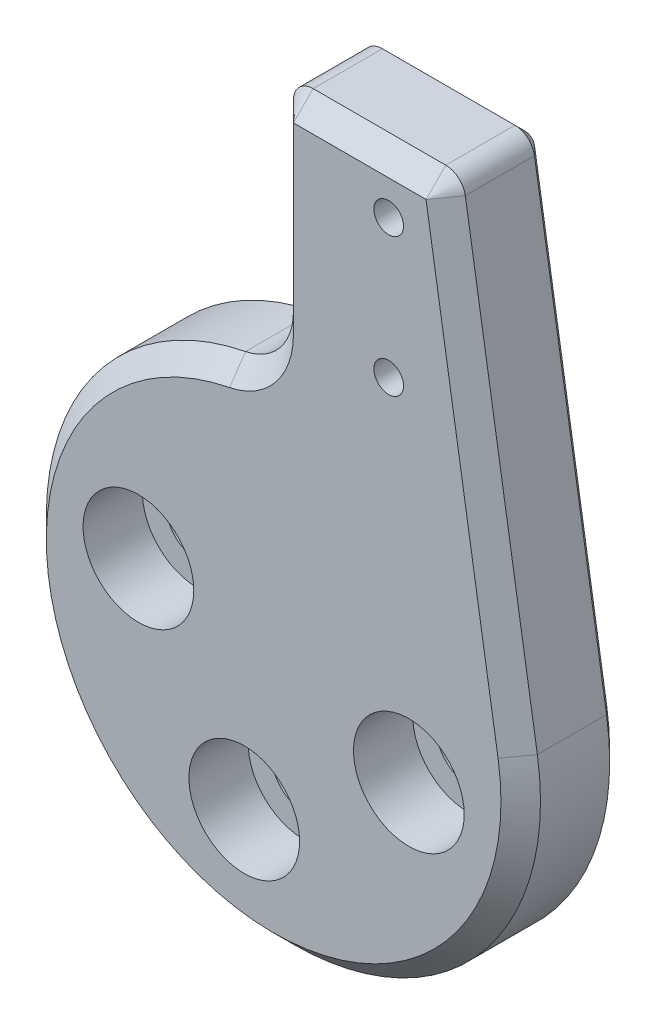
ISO-10303-21;
HEADER;
FILE_DESCRIPTION(('STEP AP214'),'2;1');
FILE_NAME('part.step','',(''),(''),'','','');
FILE_SCHEMA(('AUTOMOTIVE_DESIGN { 1 0 10303 214 1 1 1 1 }'));
ENDSEC;
DATA;
#1=APPLICATION_CONTEXT('core data for automotive mechanical design processes');
#2=APPLICATION_PROTOCOL_DEFINITION('international standard','automotive_design',2000,#1);
#3=PRODUCT_CONTEXT('',#1,'mechanical');
#4=PRODUCT('Part','Part','',(#3));
#5=PRODUCT_RELATED_PRODUCT_CATEGORY('part','',(#4));
#6=PRODUCT_DEFINITION_FORMATION('','',#4);
#7=PRODUCT_DEFINITION_CONTEXT('part definition',#1,'design');
#8=PRODUCT_DEFINITION('design','',#6,#7);
#9=PRODUCT_DEFINITION_SHAPE('','',#8);
#10=(LENGTH_UNIT() NAMED_UNIT(*) SI_UNIT(.MILLI.,.METRE.));
#11=(NAMED_UNIT(*) PLANE_ANGLE_UNIT() SI_UNIT($,.RADIAN.));
#12=(NAMED_UNIT(*) SI_UNIT($,.STERADIAN.) SOLID_ANGLE_UNIT());
#13=UNCERTAINTY_MEASURE_WITH_UNIT(LENGTH_MEASURE(1.E-05),#10,'distance_accuracy_value','');
#14=(GEOMETRIC_REPRESENTATION_CONTEXT(3) GLOBAL_UNCERTAINTY_ASSIGNED_CONTEXT((#13)) GLOBAL_UNIT_ASSIGNED_CONTEXT((#10,
#11,#12)) REPRESENTATION_CONTEXT('',''));
#15=CARTESIAN_POINT('',(0.,0.,0.));
#16=DIRECTION('',(0.,0.,1.));
#17=DIRECTION('',(1.,0.,0.));
#18=AXIS2_PLACEMENT_3D('',#15,#16,#17);
#19=CARTESIAN_POINT('',(-1.48749999993683,-6.8401274660351,5.));
#20=DIRECTION('',(0.,0.,-1.));
#21=DIRECTION('',(-1.,0.,0.));
#22=AXIS2_PLACEMENT_3D('',#19,#20,#21);
#23=CYLINDRICAL_SURFACE('',#22,1.6);
#24=CARTESIAN_POINT('',(-1.48749999993683,-6.8401274660351,0.));
#25=DIRECTION('',(0.,0.,1.));
#26=DIRECTION('',(1.,0.,0.));
#27=AXIS2_PLACEMENT_3D('',#24,#25,#26);
#28=CIRCLE('',#27,1.6);
#29=CARTESIAN_POINT('',(0.112500000063169,-6.8401274660351,0.));
#30=VERTEX_POINT('',#29);
#31=EDGE_CURVE('E302',#30,#30,#28,.T.);
#32=ORIENTED_EDGE('',*,*,#31,.F.);
#33=EDGE_LOOP('',(#32));
#34=FACE_BOUND('',#33,.T.);
#35=CARTESIAN_POINT('',(-1.48749999993683,-6.8401274660351,2.));
#36=DIRECTION('',(0.,0.,1.));
#37=DIRECTION('',(1.,0.,0.));
#38=AXIS2_PLACEMENT_3D('',#35,#36,#37);
#39=CIRCLE('',#38,1.6);
#40=CARTESIAN_POINT('',(0.112500000063169,-6.8401274660351,2.));
#41=VERTEX_POINT('',#40);
#42=EDGE_CURVE('E198',#41,#41,#39,.T.);
#43=ORIENTED_EDGE('',*,*,#42,.T.);
#44=EDGE_LOOP('',(#43));
#45=FACE_BOUND('',#44,.T.);
#46=ADVANCED_FACE('F41',(#34,#45),#23,.F.);
#47=CARTESIAN_POINT('',(6.84012746598076,-1.48750000011751,5.));
#48=DIRECTION('',(0.,0.,-1.));
#49=DIRECTION('',(-1.,0.,0.));
#50=AXIS2_PLACEMENT_3D('',#47,#48,#49);
#51=CYLINDRICAL_SURFACE('',#50,1.6);
#52=CARTESIAN_POINT('',(6.84012746598076,-1.48750000011751,0.));
#53=DIRECTION('',(0.,0.,1.));
#54=DIRECTION('',(1.,0.,0.));
#55=AXIS2_PLACEMENT_3D('',#52,#53,#54);
#56=CIRCLE('',#55,1.6);
#57=CARTESIAN_POINT('',(8.44012746598076,-1.48750000011751,0.));
#58=VERTEX_POINT('',#57);
#59=EDGE_CURVE('E299',#58,#58,#56,.T.);
#60=ORIENTED_EDGE('',*,*,#59,.F.);
#61=EDGE_LOOP('',(#60));
#62=FACE_BOUND('',#61,.T.);
#63=CARTESIAN_POINT('',(6.84012746598076,-1.48750000011751,2.));
#64=DIRECTION('',(0.,0.,1.));
#65=DIRECTION('',(1.,0.,0.));
#66=AXIS2_PLACEMENT_3D('',#63,#64,#65);
#67=CIRCLE('',#66,1.6);
#68=CARTESIAN_POINT('',(8.44012746598076,-1.48750000011751,2.));
#69=VERTEX_POINT('',#68);
#70=EDGE_CURVE('E217',#69,#69,#67,.T.);
#71=ORIENTED_EDGE('',*,*,#70,.T.);
#72=EDGE_LOOP('',(#71));
#73=FACE_BOUND('',#72,.T.);
#74=ADVANCED_FACE('F374',(#62,#73),#51,.F.);
#75=CARTESIAN_POINT('',(-6.84012746585444,1.48749999988239,5.));
#76=DIRECTION('',(0.,0.,-1.));
#77=DIRECTION('',(-1.,0.,0.));
#78=AXIS2_PLACEMENT_3D('',#75,#76,#77);
#79=CYLINDRICAL_SURFACE('',#78,1.6);
#80=CARTESIAN_POINT('',(-6.84012746585444,1.48749999988239,0.));
#81=DIRECTION('',(0.,0.,1.));
#82=DIRECTION('',(1.,0.,0.));
#83=AXIS2_PLACEMENT_3D('',#80,#81,#82);
#84=CIRCLE('',#83,1.6);
#85=CARTESIAN_POINT('',(-5.24012746585444,1.48749999988239,0.));
#86=VERTEX_POINT('',#85);
#87=EDGE_CURVE('E290',#86,#86,#84,.T.);
#88=ORIENTED_EDGE('',*,*,#87,.F.);
#89=EDGE_LOOP('',(#88));
#90=FACE_BOUND('',#89,.T.);
#91=CARTESIAN_POINT('',(-6.84012746585444,1.48749999988239,2.));
#92=DIRECTION('',(0.,0.,1.));
#93=DIRECTION('',(1.,0.,0.));
#94=AXIS2_PLACEMENT_3D('',#91,#92,#93);
#95=CIRCLE('',#94,1.6);
#96=CARTESIAN_POINT('',(-5.24012746585444,1.48749999988239,2.));
#97=VERTEX_POINT('',#96);
#98=EDGE_CURVE('E214',#97,#97,#95,.T.);
#99=ORIENTED_EDGE('',*,*,#98,.T.);
#100=EDGE_LOOP('',(#99));
#101=FACE_BOUND('',#100,.T.);
#102=ADVANCED_FACE('F380',(#90,#101),#79,.F.);
#103=CARTESIAN_POINT('',(-3.,15.2069063256196,5.));
#104=DIRECTION('',(0.,0.,-1.));
#105=DIRECTION('',(-1.,0.,0.));
#106=AXIS2_PLACEMENT_3D('',#103,#104,#105);
#107=CYLINDRICAL_SURFACE('',#106,3.);
#108=DIRECTION('',(0.,0.,-1.));
#109=VECTOR('',#108,1.);
#110=CARTESIAN_POINT('',(0.,15.2069063256196,5.));
#111=LINE('',#110,#109);
#112=CARTESIAN_POINT('',(0.,15.2069063256196,4.00000000000001));
#113=VERTEX_POINT('',#112);
#114=CARTESIAN_POINT('',(0.,15.2069063256196,0.500000000000007));
#115=VERTEX_POINT('',#114);
#116=EDGE_CURVE('E293',#113,#115,#111,.T.);
#117=ORIENTED_EDGE('',*,*,#116,.T.);
#118=CARTESIAN_POINT('',(-3.,15.2069063256196,0.500000000000007));
#119=DIRECTION('',(0.,0.,1.));
#120=DIRECTION('',(1.,0.,0.));
#121=AXIS2_PLACEMENT_3D('',#118,#119,#120);
#122=CIRCLE('',#121,3.);
#123=CARTESIAN_POINT('',(-2.41935483870505,12.2636341335408,0.500000000000007));
#124=VERTEX_POINT('',#123);
#125=EDGE_CURVE('E162',#115,#124,#122,.F.);
#126=ORIENTED_EDGE('',*,*,#125,.T.);
#127=DIRECTION('',(0.,0.,-1.));
#128=VECTOR('',#127,1.);
#129=CARTESIAN_POINT('',(-2.41935483870505,12.2636341335408,5.));
#130=LINE('',#129,#128);
#131=CARTESIAN_POINT('',(-2.41935483870505,12.2636341335408,4.00000000000001));
#132=VERTEX_POINT('',#131);
#133=EDGE_CURVE('E143',#132,#124,#130,.T.);
#134=ORIENTED_EDGE('',*,*,#133,.F.);
#135=CARTESIAN_POINT('',(-3.,15.2069063256196,4.00000000000001));
#136=DIRECTION('',(0.,0.,1.));
#137=DIRECTION('',(1.,0.,0.));
#138=AXIS2_PLACEMENT_3D('',#135,#136,#137);
#139=CIRCLE('',#138,3.);
#140=EDGE_CURVE('E159',#132,#113,#139,.T.);
#141=ORIENTED_EDGE('',*,*,#140,.T.);
#142=EDGE_LOOP('',(#117,#126,#134,#141));
#143=FACE_BOUND('',#142,.T.);
#144=ADVANCED_FACE('F157',(#143),#107,.F.);
#145=CARTESIAN_POINT('',(0.,0.,5.));
#146=DIRECTION('',(0.,0.,-1.));
#147=DIRECTION('',(-1.,0.,0.));
#148=AXIS2_PLACEMENT_3D('',#145,#146,#147);
#149=CYLINDRICAL_SURFACE('',#148,12.4999999998765);
#150=ORIENTED_EDGE('',*,*,#133,.T.);
#151=CARTESIAN_POINT('',(0.,0.,0.500000000000007));
#152=DIRECTION('',(0.,0.,1.));
#153=DIRECTION('',(1.,0.,0.));
#154=AXIS2_PLACEMENT_3D('',#151,#152,#153);
#155=CIRCLE('',#154,12.4999999998765);
#156=CARTESIAN_POINT('',(12.3413897321244,1.98496838179509,0.500000000000007));
#157=VERTEX_POINT('',#156);
#158=EDGE_CURVE('E238',#124,#157,#155,.T.);
#159=ORIENTED_EDGE('',*,*,#158,.T.);
#160=DIRECTION('',(0.,0.,-1.));
#161=VECTOR('',#160,1.);
#162=CARTESIAN_POINT('',(12.3413897321244,1.98496838179509,5.));
#163=LINE('',#162,#161);
#164=CARTESIAN_POINT('',(12.3413897321244,1.98496838179509,4.00000000000001));
#165=VERTEX_POINT('',#164);
#166=EDGE_CURVE('E145',#165,#157,#163,.T.);
#167=ORIENTED_EDGE('',*,*,#166,.F.);
#168=CARTESIAN_POINT('',(0.,0.,4.00000000000001));
#169=DIRECTION('',(0.,0.,1.));
#170=DIRECTION('',(1.,0.,0.));
#171=AXIS2_PLACEMENT_3D('',#168,#169,#170);
#172=CIRCLE('',#171,12.4999999998765);
#173=EDGE_CURVE('E140',#165,#132,#172,.F.);
#174=ORIENTED_EDGE('',*,*,#173,.T.);
#175=EDGE_LOOP('',(#150,#159,#167,#174));
#176=FACE_BOUND('',#175,.T.);
#177=ADVANCED_FACE('F142',(#176),#149,.T.);
#178=CARTESIAN_POINT('',(12.3413897321244,1.98496838179509,5.));
#179=DIRECTION('',(0.987311178579709,0.158797470545176,0.));
#180=DIRECTION('',(-0.158797470545176,0.987311178579709,0.));
#181=AXIS2_PLACEMENT_3D('',#178,#179,#180);
#182=PLANE('',#181);
#183=ORIENTED_EDGE('',*,*,#166,.T.);
#184=DIRECTION('',(-0.158797470545176,0.987311178579709,0.));
#185=VECTOR('',#184,1.);
#186=CARTESIAN_POINT('',(8.69591975046541,24.6504003418386,0.500000000000007));
#187=LINE('',#186,#185);
#188=CARTESIAN_POINT('',(8.69591975046541,24.6504003418386,0.500000000000007));
#189=VERTEX_POINT('',#188);
#190=EDGE_CURVE('E242',#157,#189,#187,.T.);
#191=ORIENTED_EDGE('',*,*,#190,.T.);
#192=DIRECTION('',(0.,0.,-1.));
#193=VECTOR('',#192,1.);
#194=CARTESIAN_POINT('',(8.69591975046541,24.6504003418386,5.));
#195=LINE('',#194,#193);
#196=CARTESIAN_POINT('',(8.69591975046541,24.6504003418386,4.00000000000001));
#197=VERTEX_POINT('',#196);
#198=EDGE_CURVE('E315',#197,#189,#195,.T.);
#199=ORIENTED_EDGE('',*,*,#198,.F.);
#200=DIRECTION('',(0.158797470545176,-0.987311178579709,0.));
#201=VECTOR('',#200,1.);
#202=CARTESIAN_POINT('',(12.3413897321244,1.98496838179509,4.00000000000001));
#203=LINE('',#202,#201);
#204=EDGE_CURVE('E189',#197,#165,#203,.T.);
#205=ORIENTED_EDGE('',*,*,#204,.T.);
#206=EDGE_LOOP('',(#183,#191,#199,#205));
#207=FACE_BOUND('',#206,.T.);
#208=ADVANCED_FACE('F317',(#207),#182,.T.);
#209=CARTESIAN_POINT('',(7.7086085718857,24.4916028712934,5.));
#210=DIRECTION('',(0.,0.,-1.));
#211=DIRECTION('',(-1.,0.,0.));
#212=AXIS2_PLACEMENT_3D('',#209,#210,#211);
#213=CYLINDRICAL_SURFACE('',#212,1.);
#214=ORIENTED_EDGE('',*,*,#198,.T.);
#215=CARTESIAN_POINT('',(7.7086085718857,24.4916028712934,0.500000000000007));
#216=DIRECTION('',(0.,0.,1.));
#217=DIRECTION('',(1.,0.,0.));
#218=AXIS2_PLACEMENT_3D('',#215,#216,#217);
#219=CIRCLE('',#218,1.);
#220=CARTESIAN_POINT('',(7.70860857188569,25.4916028712934,0.500000000000007));
#221=VERTEX_POINT('',#220);
#222=EDGE_CURVE('E51',#189,#221,#219,.T.);
#223=ORIENTED_EDGE('',*,*,#222,.T.);
#224=DIRECTION('',(0.,0.,-1.));
#225=VECTOR('',#224,1.);
#226=CARTESIAN_POINT('',(7.70860857188569,25.4916028712934,5.));
#227=LINE('',#226,#225);
#228=CARTESIAN_POINT('',(7.70860857188569,25.4916028712934,4.00000000000001));
#229=VERTEX_POINT('',#228);
#230=EDGE_CURVE('E313',#229,#221,#227,.T.);
#231=ORIENTED_EDGE('',*,*,#230,.F.);
#232=CARTESIAN_POINT('',(7.7086085718857,24.4916028712934,4.00000000000001));
#233=DIRECTION('',(0.,0.,1.));
#234=DIRECTION('',(1.,0.,0.));
#235=AXIS2_PLACEMENT_3D('',#232,#233,#234);
#236=CIRCLE('',#235,1.);
#237=EDGE_CURVE('E193',#229,#197,#236,.F.);
#238=ORIENTED_EDGE('',*,*,#237,.T.);
#239=EDGE_LOOP('',(#214,#223,#231,#238));
#240=FACE_BOUND('',#239,.T.);
#241=ADVANCED_FACE('F364',(#240),#213,.T.);
#242=CARTESIAN_POINT('',(0.,25.4916028712934,5.));
#243=DIRECTION('',(0.,1.,0.));
#244=DIRECTION('',(0.,0.,1.));
#245=AXIS2_PLACEMENT_3D('',#242,#243,#244);
#246=PLANE('',#245);
#247=ORIENTED_EDGE('',*,*,#230,.T.);
#248=DIRECTION('',(-1.,0.,0.));
#249=VECTOR('',#248,1.);
#250=CARTESIAN_POINT('',(1.00000000000001,25.4916028712934,0.500000000000007));
#251=LINE('',#250,#249);
#252=CARTESIAN_POINT('',(1.00000000000001,25.4916028712934,0.500000000000007));
#253=VERTEX_POINT('',#252);
#254=EDGE_CURVE('E11',#221,#253,#251,.T.);
#255=ORIENTED_EDGE('',*,*,#254,.T.);
#256=DIRECTION('',(0.,0.,-1.));
#257=VECTOR('',#256,1.);
#258=CARTESIAN_POINT('',(1.00000000000001,25.4916028712934,5.));
#259=LINE('',#258,#257);
#260=CARTESIAN_POINT('',(1.00000000000001,25.4916028712934,4.00000000000001));
#261=VERTEX_POINT('',#260);
#262=EDGE_CURVE('E311',#261,#253,#259,.T.);
#263=ORIENTED_EDGE('',*,*,#262,.F.);
#264=DIRECTION('',(1.,0.,0.));
#265=VECTOR('',#264,1.);
#266=CARTESIAN_POINT('',(0.,25.4916028712934,4.00000000000001));
#267=LINE('',#266,#265);
#268=EDGE_CURVE('E195',#261,#229,#267,.T.);
#269=ORIENTED_EDGE('',*,*,#268,.T.);
#270=EDGE_LOOP('',(#247,#255,#263,#269));
#271=FACE_BOUND('',#270,.T.);
#272=ADVANCED_FACE('F355',(#271),#246,.T.);
#273=CARTESIAN_POINT('',(1.,24.4916028712934,5.));
#274=DIRECTION('',(0.,0.,-1.));
#275=DIRECTION('',(-1.,0.,0.));
#276=AXIS2_PLACEMENT_3D('',#273,#274,#275);
#277=CYLINDRICAL_SURFACE('',#276,1.);
#278=ORIENTED_EDGE('',*,*,#262,.T.);
#279=CARTESIAN_POINT('',(1.,24.4916028712934,0.500000000000007));
#280=DIRECTION('',(0.,0.,1.));
#281=DIRECTION('',(1.,0.,0.));
#282=AXIS2_PLACEMENT_3D('',#279,#280,#281);
#283=CIRCLE('',#282,1.);
#284=CARTESIAN_POINT('',(0.,24.4916028712934,0.500000000000007));
#285=VERTEX_POINT('',#284);
#286=EDGE_CURVE('E244',#253,#285,#283,.T.);
#287=ORIENTED_EDGE('',*,*,#286,.T.);
#288=DIRECTION('',(0.,0.,-1.));
#289=VECTOR('',#288,1.);
#290=CARTESIAN_POINT('',(0.,24.4916028712934,5.));
#291=LINE('',#290,#289);
#292=CARTESIAN_POINT('',(0.,24.4916028712934,4.00000000000001));
#293=VERTEX_POINT('',#292);
#294=EDGE_CURVE('E308',#293,#285,#291,.T.);
#295=ORIENTED_EDGE('',*,*,#294,.F.);
#296=CARTESIAN_POINT('',(1.,24.4916028712934,4.00000000000001));
#297=DIRECTION('',(0.,0.,1.));
#298=DIRECTION('',(1.,0.,0.));
#299=AXIS2_PLACEMENT_3D('',#296,#297,#298);
#300=CIRCLE('',#299,1.);
#301=EDGE_CURVE('E191',#293,#261,#300,.F.);
#302=ORIENTED_EDGE('',*,*,#301,.T.);
#303=EDGE_LOOP('',(#278,#287,#295,#302));
#304=FACE_BOUND('',#303,.T.);
#305=ADVANCED_FACE('F343',(#304),#277,.T.);
#306=CARTESIAN_POINT('',(5.82086052217418,15.75,5.));
#307=DIRECTION('',(0.,0.,-1.));
#308=DIRECTION('',(-1.,0.,0.));
#309=AXIS2_PLACEMENT_3D('',#306,#307,#308);
#310=CYLINDRICAL_SURFACE('',#309,0.75);
#311=CARTESIAN_POINT('',(5.82086052217418,15.75,5.));
#312=DIRECTION('',(0.,0.,1.));
#313=DIRECTION('',(1.,0.,0.));
#314=AXIS2_PLACEMENT_3D('',#311,#312,#313);
#315=CIRCLE('',#314,0.75);
#316=CARTESIAN_POINT('',(6.57086052217418,15.75,5.));
#317=VERTEX_POINT('',#316);
#318=EDGE_CURVE('E289',#317,#317,#315,.T.);
#319=ORIENTED_EDGE('',*,*,#318,.T.);
#320=EDGE_LOOP('',(#319));
#321=FACE_BOUND('',#320,.T.);
#322=CARTESIAN_POINT('',(5.82086052217418,15.75,0.));
#323=DIRECTION('',(0.,0.,1.));
#324=DIRECTION('',(1.,0.,0.));
#325=AXIS2_PLACEMENT_3D('',#322,#323,#324);
#326=CIRCLE('',#325,0.75);
#327=CARTESIAN_POINT('',(6.57086052217418,15.75,0.));
#328=VERTEX_POINT('',#327);
#329=EDGE_CURVE('E296',#328,#328,#326,.T.);
#330=ORIENTED_EDGE('',*,*,#329,.F.);
#331=EDGE_LOOP('',(#330));
#332=FACE_BOUND('',#331,.T.);
#333=ADVANCED_FACE('F388',(#321,#332),#310,.F.);
#334=CARTESIAN_POINT('',(5.82086052217415,22.75,5.));
#335=DIRECTION('',(0.,0.,-1.));
#336=DIRECTION('',(-1.,0.,0.));
#337=AXIS2_PLACEMENT_3D('',#334,#335,#336);
#338=CYLINDRICAL_SURFACE('',#337,0.75);
#339=CARTESIAN_POINT('',(5.82086052217415,22.75,5.));
#340=DIRECTION('',(0.,0.,1.));
#341=DIRECTION('',(1.,0.,0.));
#342=AXIS2_PLACEMENT_3D('',#339,#340,#341);
#343=CIRCLE('',#342,0.75);
#344=CARTESIAN_POINT('',(6.57086052217415,22.75,5.));
#345=VERTEX_POINT('',#344);
#346=EDGE_CURVE('E286',#345,#345,#343,.T.);
#347=ORIENTED_EDGE('',*,*,#346,.T.);
#348=EDGE_LOOP('',(#347));
#349=FACE_BOUND('',#348,.T.);
#350=CARTESIAN_POINT('',(5.82086052217415,22.75,0.));
#351=DIRECTION('',(0.,0.,1.));
#352=DIRECTION('',(1.,0.,0.));
#353=AXIS2_PLACEMENT_3D('',#350,#351,#352);
#354=CIRCLE('',#353,0.75);
#355=CARTESIAN_POINT('',(6.57086052217415,22.75,0.));
#356=VERTEX_POINT('',#355);
#357=EDGE_CURVE('E213',#356,#356,#354,.T.);
#358=ORIENTED_EDGE('',*,*,#357,.F.);
#359=EDGE_LOOP('',(#358));
#360=FACE_BOUND('',#359,.T.);
#361=ADVANCED_FACE('F391',(#349,#360),#338,.F.);
#362=CARTESIAN_POINT('',(0.,0.,5.));
#363=DIRECTION('',(1.,0.,0.));
#364=DIRECTION('',(0.,1.,0.));
#365=AXIS2_PLACEMENT_3D('',#362,#363,#364);
#366=PLANE('',#365);
#367=ORIENTED_EDGE('',*,*,#294,.T.);
#368=DIRECTION('',(0.,-1.,0.));
#369=VECTOR('',#368,1.);
#370=CARTESIAN_POINT('',(0.,0.,0.500000000000007));
#371=LINE('',#370,#369);
#372=EDGE_CURVE('E240',#285,#115,#371,.T.);
#373=ORIENTED_EDGE('',*,*,#372,.T.);
#374=ORIENTED_EDGE('',*,*,#116,.F.);
#375=DIRECTION('',(0.,1.,0.));
#376=VECTOR('',#375,1.);
#377=CARTESIAN_POINT('',(0.,24.4916028712934,4.00000000000001));
#378=LINE('',#377,#376);
#379=EDGE_CURVE('E150',#113,#293,#378,.T.);
#380=ORIENTED_EDGE('',*,*,#379,.T.);
#381=EDGE_LOOP('',(#367,#373,#374,#380));
#382=FACE_BOUND('',#381,.T.);
#383=ADVANCED_FACE('F346',(#382),#366,.F.);
#384=CARTESIAN_POINT('',(0.,0.,5.));
#385=DIRECTION('',(0.,0.,1.));
#386=DIRECTION('',(1.,0.,0.));
#387=AXIS2_PLACEMENT_3D('',#384,#385,#386);
#388=PLANE('',#387);
#389=CARTESIAN_POINT('',(6.84012746598076,-1.48750000011751,5.));
#390=DIRECTION('',(0.,0.,1.));
#391=DIRECTION('',(1.,0.,0.));
#392=AXIS2_PLACEMENT_3D('',#389,#390,#391);
#393=CIRCLE('',#392,2.8);
#394=CARTESIAN_POINT('',(9.64012746598076,-1.48750000011751,5.));
#395=VERTEX_POINT('',#394);
#396=EDGE_CURVE('E271',#395,#395,#393,.T.);
#397=ORIENTED_EDGE('',*,*,#396,.F.);
#398=EDGE_LOOP('',(#397));
#399=FACE_BOUND('',#398,.T.);
#400=CARTESIAN_POINT('',(-1.48749999993683,-6.8401274660351,5.));
#401=DIRECTION('',(0.,0.,1.));
#402=DIRECTION('',(1.,0.,0.));
#403=AXIS2_PLACEMENT_3D('',#400,#401,#402);
#404=CIRCLE('',#403,2.8);
#405=CARTESIAN_POINT('',(1.31250000006317,-6.8401274660351,5.));
#406=VERTEX_POINT('',#405);
#407=EDGE_CURVE('E285',#406,#406,#404,.T.);
#408=ORIENTED_EDGE('',*,*,#407,.F.);
#409=EDGE_LOOP('',(#408));
#410=FACE_BOUND('',#409,.T.);
#411=CARTESIAN_POINT('',(-6.84012746585444,1.48749999988239,5.));
#412=DIRECTION('',(0.,0.,1.));
#413=DIRECTION('',(1.,0.,0.));
#414=AXIS2_PLACEMENT_3D('',#411,#412,#413);
#415=CIRCLE('',#414,2.8);
#416=CARTESIAN_POINT('',(-4.04012746585444,1.48749999988239,5.));
#417=VERTEX_POINT('',#416);
#418=EDGE_CURVE('E282',#417,#417,#415,.T.);
#419=ORIENTED_EDGE('',*,*,#418,.F.);
#420=EDGE_LOOP('',(#419));
#421=FACE_BOUND('',#420,.T.);
#422=DIRECTION('',(0.,-1.,0.));
#423=VECTOR('',#422,1.);
#424=CARTESIAN_POINT('',(1.,15.2069063256196,5.));
#425=LINE('',#424,#423);
#426=CARTESIAN_POINT('',(1.,24.4916028712934,5.));
#427=VERTEX_POINT('',#426);
#428=CARTESIAN_POINT('',(1.,15.2069063256196,5.));
#429=VERTEX_POINT('',#428);
#430=EDGE_CURVE('E184',#427,#429,#425,.T.);
#431=ORIENTED_EDGE('',*,*,#430,.T.);
#432=CARTESIAN_POINT('',(-3.,15.2069063256196,5.));
#433=DIRECTION('',(0.,0.,1.));
#434=DIRECTION('',(1.,0.,0.));
#435=AXIS2_PLACEMENT_3D('',#432,#433,#434);
#436=CIRCLE('',#435,4.);
#437=CARTESIAN_POINT('',(-2.22580645160673,11.2825434028478,5.));
#438=VERTEX_POINT('',#437);
#439=EDGE_CURVE('E151',#429,#438,#436,.F.);
#440=ORIENTED_EDGE('',*,*,#439,.T.);
#441=CARTESIAN_POINT('',(0.,0.,5.));
#442=DIRECTION('',(0.,0.,1.));
#443=DIRECTION('',(1.,0.,0.));
#444=AXIS2_PLACEMENT_3D('',#441,#442,#443);
#445=CIRCLE('',#444,11.4999999998765);
#446=CARTESIAN_POINT('',(11.3540785535447,1.82617091124991,5.));
#447=VERTEX_POINT('',#446);
#448=EDGE_CURVE('E167',#438,#447,#445,.T.);
#449=ORIENTED_EDGE('',*,*,#448,.T.);
#450=DIRECTION('',(-0.158797470545176,0.987311178579709,0.));
#451=VECTOR('',#450,1.);
#452=CARTESIAN_POINT('',(11.3540785535447,1.82617091124991,5.));
#453=LINE('',#452,#451);
#454=CARTESIAN_POINT('',(7.7086085718857,24.4916028712934,5.));
#455=VERTEX_POINT('',#454);
#456=EDGE_CURVE('E179',#447,#455,#453,.T.);
#457=ORIENTED_EDGE('',*,*,#456,.T.);
#458=DIRECTION('',(-1.,0.,0.));
#459=VECTOR('',#458,1.);
#460=CARTESIAN_POINT('',(0.,24.4916028712934,5.));
#461=LINE('',#460,#459);
#462=EDGE_CURVE('E177',#455,#427,#461,.T.);
#463=ORIENTED_EDGE('',*,*,#462,.T.);
#464=EDGE_LOOP('',(#431,#440,#449,#457,#463));
#465=FACE_BOUND('',#464,.T.);
#466=ORIENTED_EDGE('',*,*,#346,.F.);
#467=EDGE_LOOP('',(#466));
#468=FACE_BOUND('',#467,.T.);
#469=ORIENTED_EDGE('',*,*,#318,.F.);
#470=EDGE_LOOP('',(#469));
#471=FACE_BOUND('',#470,.T.);
#472=ADVANCED_FACE('F398',(#399,#410,#421,#465,#468,#471),#388,.T.);
#473=CARTESIAN_POINT('',(0.,0.,0.));
#474=DIRECTION('',(0.,0.,1.));
#475=DIRECTION('',(1.,0.,0.));
#476=AXIS2_PLACEMENT_3D('',#473,#474,#475);
#477=PLANE('',#476);
#478=CARTESIAN_POINT('',(0.,0.,0.));
#479=DIRECTION('',(0.,0.,1.));
#480=DIRECTION('',(1.,0.,0.));
#481=AXIS2_PLACEMENT_3D('',#478,#479,#480);
#482=CIRCLE('',#481,11.9999999998765);
#483=CARTESIAN_POINT('',(11.8477341428346,1.9055696465225,0.));
#484=VERTEX_POINT('',#483);
#485=CARTESIAN_POINT('',(-2.32258064515589,11.7730887681943,0.));
#486=VERTEX_POINT('',#485);
#487=EDGE_CURVE('E232',#484,#486,#482,.F.);
#488=ORIENTED_EDGE('',*,*,#487,.T.);
#489=CARTESIAN_POINT('',(-3.,15.2069063256196,0.));
#490=DIRECTION('',(0.,0.,1.));
#491=DIRECTION('',(1.,0.,0.));
#492=AXIS2_PLACEMENT_3D('',#489,#490,#491);
#493=CIRCLE('',#492,3.5);
#494=CARTESIAN_POINT('',(0.5,15.2069063256196,0.));
#495=VERTEX_POINT('',#494);
#496=EDGE_CURVE('E234',#486,#495,#493,.T.);
#497=ORIENTED_EDGE('',*,*,#496,.T.);
#498=DIRECTION('',(0.,1.,0.));
#499=VECTOR('',#498,1.);
#500=CARTESIAN_POINT('',(0.5,0.,0.));
#501=LINE('',#500,#499);
#502=CARTESIAN_POINT('',(0.499999999999999,24.4916028712934,0.));
#503=VERTEX_POINT('',#502);
#504=EDGE_CURVE('E230',#495,#503,#501,.T.);
#505=ORIENTED_EDGE('',*,*,#504,.T.);
#506=CARTESIAN_POINT('',(1.,24.4916028712934,0.));
#507=DIRECTION('',(0.,0.,1.));
#508=DIRECTION('',(1.,0.,0.));
#509=AXIS2_PLACEMENT_3D('',#506,#507,#508);
#510=CIRCLE('',#509,0.5);
#511=CARTESIAN_POINT('',(1.,24.9916028712934,0.));
#512=VERTEX_POINT('',#511);
#513=EDGE_CURVE('E226',#503,#512,#510,.F.);
#514=ORIENTED_EDGE('',*,*,#513,.T.);
#515=DIRECTION('',(1.,0.,0.));
#516=VECTOR('',#515,1.);
#517=CARTESIAN_POINT('',(7.70860857188569,24.9916028712934,0.));
#518=LINE('',#517,#516);
#519=CARTESIAN_POINT('',(7.70860857188569,24.9916028712934,0.));
#520=VERTEX_POINT('',#519);
#521=EDGE_CURVE('E197',#512,#520,#518,.T.);
#522=ORIENTED_EDGE('',*,*,#521,.T.);
#523=CARTESIAN_POINT('',(7.7086085718857,24.4916028712934,0.));
#524=DIRECTION('',(0.,0.,1.));
#525=DIRECTION('',(1.,0.,0.));
#526=AXIS2_PLACEMENT_3D('',#523,#524,#525);
#527=CIRCLE('',#526,0.500000000000001);
#528=CARTESIAN_POINT('',(8.20226416117555,24.571001606566,0.));
#529=VERTEX_POINT('',#528);
#530=EDGE_CURVE('E224',#520,#529,#527,.F.);
#531=ORIENTED_EDGE('',*,*,#530,.T.);
#532=DIRECTION('',(0.158797470545176,-0.987311178579709,0.));
#533=VECTOR('',#532,1.);
#534=CARTESIAN_POINT('',(11.8477341428346,1.9055696465225,0.));
#535=LINE('',#534,#533);
#536=EDGE_CURVE('E228',#529,#484,#535,.T.);
#537=ORIENTED_EDGE('',*,*,#536,.T.);
#538=EDGE_LOOP('',(#488,#497,#505,#514,#522,#531,#537));
#539=FACE_BOUND('',#538,.T.);
#540=ORIENTED_EDGE('',*,*,#357,.T.);
#541=EDGE_LOOP('',(#540));
#542=FACE_BOUND('',#541,.T.);
#543=ORIENTED_EDGE('',*,*,#329,.T.);
#544=EDGE_LOOP('',(#543));
#545=FACE_BOUND('',#544,.T.);
#546=ORIENTED_EDGE('',*,*,#59,.T.);
#547=EDGE_LOOP('',(#546));
#548=FACE_BOUND('',#547,.T.);
#549=ORIENTED_EDGE('',*,*,#31,.T.);
#550=EDGE_LOOP('',(#549));
#551=FACE_BOUND('',#550,.T.);
#552=ORIENTED_EDGE('',*,*,#87,.T.);
#553=EDGE_LOOP('',(#552));
#554=FACE_BOUND('',#553,.T.);
#555=ADVANCED_FACE('F329',(#539,#542,#545,#548,#551,#554),#477,.F.);
#556=CARTESIAN_POINT('',(7.7086085718857,24.4916028712934,4.00000000000001));
#557=DIRECTION('',(0.,0.,-1.));
#558=DIRECTION('',(-1.,0.,0.));
#559=AXIS2_PLACEMENT_3D('',#556,#557,#558);
#560=CONICAL_SURFACE('',#559,1.,0.785398163397452);
#561=DIRECTION('',(-0.698134429514996,-0.112286768257767,0.707106781186545));
#562=VECTOR('',#561,1.);
#563=CARTESIAN_POINT('',(8.69591975046541,24.6504003418386,4.00000000000001));
#564=LINE('',#563,#562);
#565=EDGE_CURVE('E207',#197,#455,#564,.T.);
#566=ORIENTED_EDGE('',*,*,#565,.F.);
#567=ORIENTED_EDGE('',*,*,#237,.F.);
#568=DIRECTION('',(0.,0.70710678118655,-0.707106781186545));
#569=VECTOR('',#568,1.);
#570=CARTESIAN_POINT('',(7.7086085718857,24.4916028712934,5.));
#571=LINE('',#570,#569);
#572=EDGE_CURVE('E210',#455,#229,#571,.T.);
#573=ORIENTED_EDGE('',*,*,#572,.F.);
#574=EDGE_LOOP('',(#566,#567,#573));
#575=FACE_BOUND('',#574,.T.);
#576=ADVANCED_FACE('F363',(#575),#560,.T.);
#577=CARTESIAN_POINT('',(0.,25.4916028712934,4.00000000000001));
#578=DIRECTION('',(0.,-0.707106781186545,-0.70710678118655));
#579=DIRECTION('',(1.,0.,0.));
#580=AXIS2_PLACEMENT_3D('',#577,#578,#579);
#581=PLANE('',#580);
#582=ORIENTED_EDGE('',*,*,#572,.T.);
#583=ORIENTED_EDGE('',*,*,#268,.F.);
#584=DIRECTION('',(0.,0.70710678118655,-0.707106781186545));
#585=VECTOR('',#584,1.);
#586=CARTESIAN_POINT('',(1.,24.4916028712934,5.));
#587=LINE('',#586,#585);
#588=EDGE_CURVE('E204',#427,#261,#587,.T.);
#589=ORIENTED_EDGE('',*,*,#588,.F.);
#590=ORIENTED_EDGE('',*,*,#462,.F.);
#591=EDGE_LOOP('',(#582,#583,#589,#590));
#592=FACE_BOUND('',#591,.T.);
#593=ADVANCED_FACE('F357',(#592),#581,.F.);
#594=CARTESIAN_POINT('',(12.3413897321244,1.98496838179509,4.00000000000001));
#595=DIRECTION('',(-0.698134429514992,-0.112286768257765,-0.70710678118655));
#596=DIRECTION('',(0.158797470545176,-0.987311178579709,0.));
#597=AXIS2_PLACEMENT_3D('',#594,#595,#596);
#598=PLANE('',#597);
#599=ORIENTED_EDGE('',*,*,#565,.T.);
#600=ORIENTED_EDGE('',*,*,#456,.F.);
#601=DIRECTION('',(-0.698134429514997,-0.112286768257766,0.707106781186545));
#602=VECTOR('',#601,1.);
#603=CARTESIAN_POINT('',(12.3413897321244,1.98496838179509,4.00000000000001));
#604=LINE('',#603,#602);
#605=EDGE_CURVE('E202',#165,#447,#604,.T.);
#606=ORIENTED_EDGE('',*,*,#605,.F.);
#607=ORIENTED_EDGE('',*,*,#204,.F.);
#608=EDGE_LOOP('',(#599,#600,#606,#607));
#609=FACE_BOUND('',#608,.T.);
#610=ADVANCED_FACE('F443',(#609),#598,.F.);
#611=CARTESIAN_POINT('',(1.,24.4916028712934,4.00000000000001));
#612=DIRECTION('',(0.,0.,-1.));
#613=DIRECTION('',(-1.,0.,0.));
#614=AXIS2_PLACEMENT_3D('',#611,#612,#613);
#615=CONICAL_SURFACE('',#614,1.,0.785398163397452);
#616=ORIENTED_EDGE('',*,*,#588,.T.);
#617=ORIENTED_EDGE('',*,*,#301,.F.);
#618=DIRECTION('',(-0.70710678118655,0.,-0.707106781186545));
#619=VECTOR('',#618,1.);
#620=CARTESIAN_POINT('',(1.,24.4916028712934,5.));
#621=LINE('',#620,#619);
#622=EDGE_CURVE('E171',#427,#293,#621,.T.);
#623=ORIENTED_EDGE('',*,*,#622,.F.);
#624=EDGE_LOOP('',(#616,#617,#623));
#625=FACE_BOUND('',#624,.T.);
#626=ADVANCED_FACE('F352',(#625),#615,.T.);
#627=CARTESIAN_POINT('',(0.,0.,5.));
#628=DIRECTION('',(0.,0.,-1.));
#629=DIRECTION('',(-1.,0.,0.));
#630=AXIS2_PLACEMENT_3D('',#627,#628,#629);
#631=CONICAL_SURFACE('',#630,11.4999999998765,0.785398163397451);
#632=ORIENTED_EDGE('',*,*,#605,.T.);
#633=ORIENTED_EDGE('',*,*,#448,.F.);
#634=DIRECTION('',(0.136859377004939,-0.693735908632257,0.707106781186546));
#635=VECTOR('',#634,1.);
#636=CARTESIAN_POINT('',(-2.41935483870505,12.2636341335408,4.00000000000001));
#637=LINE('',#636,#635);
#638=EDGE_CURVE('E165',#132,#438,#637,.T.);
#639=ORIENTED_EDGE('',*,*,#638,.F.);
#640=ORIENTED_EDGE('',*,*,#173,.F.);
#641=EDGE_LOOP('',(#632,#633,#639,#640));
#642=FACE_BOUND('',#641,.T.);
#643=ADVANCED_FACE('F166',(#642),#631,.T.);
#644=CARTESIAN_POINT('',(1.,0.,5.));
#645=DIRECTION('',(-0.707106781186545,0.,0.70710678118655));
#646=DIRECTION('',(0.,1.,0.));
#647=AXIS2_PLACEMENT_3D('',#644,#645,#646);
#648=PLANE('',#647);
#649=ORIENTED_EDGE('',*,*,#622,.T.);
#650=ORIENTED_EDGE('',*,*,#379,.F.);
#651=DIRECTION('',(-0.70710678118655,0.,-0.707106781186545));
#652=VECTOR('',#651,1.);
#653=CARTESIAN_POINT('',(1.,15.2069063256196,5.));
#654=LINE('',#653,#652);
#655=EDGE_CURVE('E172',#429,#113,#654,.T.);
#656=ORIENTED_EDGE('',*,*,#655,.F.);
#657=ORIENTED_EDGE('',*,*,#430,.F.);
#658=EDGE_LOOP('',(#649,#650,#656,#657));
#659=FACE_BOUND('',#658,.T.);
#660=ADVANCED_FACE('F348',(#659),#648,.T.);
#661=CARTESIAN_POINT('',(-3.,15.2069063256196,4.00000000000001));
#662=DIRECTION('',(0.,0.,1.));
#663=DIRECTION('',(1.,0.,0.));
#664=AXIS2_PLACEMENT_3D('',#661,#662,#663);
#665=CONICAL_SURFACE('',#664,3.,0.785398163397452);
#666=ORIENTED_EDGE('',*,*,#638,.T.);
#667=ORIENTED_EDGE('',*,*,#439,.F.);
#668=ORIENTED_EDGE('',*,*,#655,.T.);
#669=ORIENTED_EDGE('',*,*,#140,.F.);
#670=EDGE_LOOP('',(#666,#667,#668,#669));
#671=FACE_BOUND('',#670,.T.);
#672=ADVANCED_FACE('F174',(#671),#665,.F.);
#673=CARTESIAN_POINT('',(-6.84012746585444,1.48749999988239,2.));
#674=DIRECTION('',(0.,0.,1.));
#675=DIRECTION('',(1.,0.,0.));
#676=AXIS2_PLACEMENT_3D('',#673,#674,#675);
#677=CYLINDRICAL_SURFACE('',#676,2.8);
#678=CARTESIAN_POINT('',(-6.84012746585444,1.48749999988239,2.));
#679=DIRECTION('',(0.,0.,1.));
#680=DIRECTION('',(1.,0.,0.));
#681=AXIS2_PLACEMENT_3D('',#678,#679,#680);
#682=CIRCLE('',#681,2.8);
#683=CARTESIAN_POINT('',(-4.04012746585444,1.48749999988239,2.));
#684=VERTEX_POINT('',#683);
#685=EDGE_CURVE('E218',#684,#684,#682,.T.);
#686=ORIENTED_EDGE('',*,*,#685,.F.);
#687=EDGE_LOOP('',(#686));
#688=FACE_BOUND('',#687,.T.);
#689=ORIENTED_EDGE('',*,*,#418,.T.);
#690=EDGE_LOOP('',(#689));
#691=FACE_BOUND('',#690,.T.);
#692=ADVANCED_FACE('F475',(#688,#691),#677,.F.);
#693=CARTESIAN_POINT('',(-6.84012746585444,1.48749999988239,2.));
#694=DIRECTION('',(0.,0.,1.));
#695=DIRECTION('',(1.,0.,0.));
#696=AXIS2_PLACEMENT_3D('',#693,#694,#695);
#697=PLANE('',#696);
#698=ORIENTED_EDGE('',*,*,#98,.F.);
#699=EDGE_LOOP('',(#698));
#700=FACE_BOUND('',#699,.T.);
#701=ORIENTED_EDGE('',*,*,#685,.T.);
#702=EDGE_LOOP('',(#701));
#703=FACE_BOUND('',#702,.T.);
#704=ADVANCED_FACE('F481',(#700,#703),#697,.T.);
#705=CARTESIAN_POINT('',(-1.48749999993683,-6.8401274660351,2.));
#706=DIRECTION('',(0.,0.,1.));
#707=DIRECTION('',(1.,0.,0.));
#708=AXIS2_PLACEMENT_3D('',#705,#706,#707);
#709=CYLINDRICAL_SURFACE('',#708,2.8);
#710=CARTESIAN_POINT('',(-1.48749999993683,-6.8401274660351,2.));
#711=DIRECTION('',(0.,0.,1.));
#712=DIRECTION('',(1.,0.,0.));
#713=AXIS2_PLACEMENT_3D('',#710,#711,#712);
#714=CIRCLE('',#713,2.8);
#715=CARTESIAN_POINT('',(1.31250000006317,-6.8401274660351,2.));
#716=VERTEX_POINT('',#715);
#717=EDGE_CURVE('E276',#716,#716,#714,.T.);
#718=ORIENTED_EDGE('',*,*,#717,.F.);
#719=EDGE_LOOP('',(#718));
#720=FACE_BOUND('',#719,.T.);
#721=ORIENTED_EDGE('',*,*,#407,.T.);
#722=EDGE_LOOP('',(#721));
#723=FACE_BOUND('',#722,.T.);
#724=ADVANCED_FACE('F489',(#720,#723),#709,.F.);
#725=CARTESIAN_POINT('',(-1.48749999993683,-6.8401274660351,2.));
#726=DIRECTION('',(0.,0.,1.));
#727=DIRECTION('',(1.,0.,0.));
#728=AXIS2_PLACEMENT_3D('',#725,#726,#727);
#729=PLANE('',#728);
#730=ORIENTED_EDGE('',*,*,#42,.F.);
#731=EDGE_LOOP('',(#730));
#732=FACE_BOUND('',#731,.T.);
#733=ORIENTED_EDGE('',*,*,#717,.T.);
#734=EDGE_LOOP('',(#733));
#735=FACE_BOUND('',#734,.T.);
#736=ADVANCED_FACE('F497',(#732,#735),#729,.T.);
#737=CARTESIAN_POINT('',(6.84012746598076,-1.48750000011751,2.));
#738=DIRECTION('',(0.,0.,1.));
#739=DIRECTION('',(1.,0.,0.));
#740=AXIS2_PLACEMENT_3D('',#737,#738,#739);
#741=CYLINDRICAL_SURFACE('',#740,2.8);
#742=CARTESIAN_POINT('',(6.84012746598076,-1.48750000011751,2.));
#743=DIRECTION('',(0.,0.,1.));
#744=DIRECTION('',(1.,0.,0.));
#745=AXIS2_PLACEMENT_3D('',#742,#743,#744);
#746=CIRCLE('',#745,2.8);
#747=CARTESIAN_POINT('',(9.64012746598076,-1.48750000011751,2.));
#748=VERTEX_POINT('',#747);
#749=EDGE_CURVE('E266',#748,#748,#746,.T.);
#750=ORIENTED_EDGE('',*,*,#749,.F.);
#751=EDGE_LOOP('',(#750));
#752=FACE_BOUND('',#751,.T.);
#753=ORIENTED_EDGE('',*,*,#396,.T.);
#754=EDGE_LOOP('',(#753));
#755=FACE_BOUND('',#754,.T.);
#756=ADVANCED_FACE('F505',(#752,#755),#741,.F.);
#757=CARTESIAN_POINT('',(6.84012746598076,-1.48750000011751,2.));
#758=DIRECTION('',(0.,0.,1.));
#759=DIRECTION('',(1.,0.,0.));
#760=AXIS2_PLACEMENT_3D('',#757,#758,#759);
#761=PLANE('',#760);
#762=ORIENTED_EDGE('',*,*,#70,.F.);
#763=EDGE_LOOP('',(#762));
#764=FACE_BOUND('',#763,.T.);
#765=ORIENTED_EDGE('',*,*,#749,.T.);
#766=EDGE_LOOP('',(#765));
#767=FACE_BOUND('',#766,.T.);
#768=ADVANCED_FACE('F513',(#764,#767),#761,.T.);
#769=CARTESIAN_POINT('',(7.7086085718857,24.4916028712934,0.));
#770=DIRECTION('',(0.,0.,1.));
#771=DIRECTION('',(1.,0.,0.));
#772=AXIS2_PLACEMENT_3D('',#769,#770,#771);
#773=CONICAL_SURFACE('',#772,0.500000000000001,0.785398163397441);
#774=DIRECTION('',(0.69813442951499,0.112286768257763,0.707106781186552));
#775=VECTOR('',#774,1.);
#776=CARTESIAN_POINT('',(8.20226416117555,24.571001606566,0.));
#777=LINE('',#776,#775);
#778=EDGE_CURVE('E259',#529,#189,#777,.T.);
#779=ORIENTED_EDGE('',*,*,#778,.F.);
#780=ORIENTED_EDGE('',*,*,#530,.F.);
#781=DIRECTION('',(0.,-0.707106781186542,-0.707106781186552));
#782=VECTOR('',#781,1.);
#783=CARTESIAN_POINT('',(7.70860857188569,25.4916028712934,0.500000000000007));
#784=LINE('',#783,#782);
#785=EDGE_CURVE('E46',#221,#520,#784,.T.);
#786=ORIENTED_EDGE('',*,*,#785,.F.);
#787=ORIENTED_EDGE('',*,*,#222,.F.);
#788=EDGE_LOOP('',(#779,#780,#786,#787));
#789=FACE_BOUND('',#788,.T.);
#790=ADVANCED_FACE('F44',(#789),#773,.T.);
#791=CARTESIAN_POINT('',(0.,24.9916028712934,0.));
#792=DIRECTION('',(0.,0.707106781186552,-0.707106781186542));
#793=DIRECTION('',(-1.,0.,0.));
#794=AXIS2_PLACEMENT_3D('',#791,#792,#793);
#795=PLANE('',#794);
#796=ORIENTED_EDGE('',*,*,#785,.T.);
#797=ORIENTED_EDGE('',*,*,#521,.F.);
#798=DIRECTION('',(0.,-0.707106781186542,-0.707106781186552));
#799=VECTOR('',#798,1.);
#800=CARTESIAN_POINT('',(1.00000000000001,25.4916028712934,0.500000000000007));
#801=LINE('',#800,#799);
#802=EDGE_CURVE('E257',#253,#512,#801,.T.);
#803=ORIENTED_EDGE('',*,*,#802,.F.);
#804=ORIENTED_EDGE('',*,*,#254,.F.);
#805=EDGE_LOOP('',(#796,#797,#803,#804));
#806=FACE_BOUND('',#805,.T.);
#807=ADVANCED_FACE('F334',(#806),#795,.T.);
#808=CARTESIAN_POINT('',(11.8477341428346,1.9055696465225,0.));
#809=DIRECTION('',(0.698134429514998,0.112286768257766,-0.707106781186544));
#810=DIRECTION('',(-0.158797470545176,0.987311178579709,0.));
#811=AXIS2_PLACEMENT_3D('',#808,#809,#810);
#812=PLANE('',#811);
#813=ORIENTED_EDGE('',*,*,#778,.T.);
#814=ORIENTED_EDGE('',*,*,#190,.F.);
#815=DIRECTION('',(0.698134429514992,0.112286768257765,0.70710678118655));
#816=VECTOR('',#815,1.);
#817=CARTESIAN_POINT('',(11.8477341428346,1.9055696465225,0.));
#818=LINE('',#817,#816);
#819=EDGE_CURVE('E254',#484,#157,#818,.T.);
#820=ORIENTED_EDGE('',*,*,#819,.F.);
#821=ORIENTED_EDGE('',*,*,#536,.F.);
#822=EDGE_LOOP('',(#813,#814,#820,#821));
#823=FACE_BOUND('',#822,.T.);
#824=ADVANCED_FACE('F321',(#823),#812,.T.);
#825=CARTESIAN_POINT('',(1.,24.4916028712934,0.));
#826=DIRECTION('',(0.,0.,1.));
#827=DIRECTION('',(1.,0.,0.));
#828=AXIS2_PLACEMENT_3D('',#825,#826,#827);
#829=CONICAL_SURFACE('',#828,0.5,0.785398163397441);
#830=ORIENTED_EDGE('',*,*,#802,.T.);
#831=ORIENTED_EDGE('',*,*,#513,.F.);
#832=DIRECTION('',(0.707106781186542,0.,-0.707106781186553));
#833=VECTOR('',#832,1.);
#834=CARTESIAN_POINT('',(0.,24.4916028712934,0.500000000000007));
#835=LINE('',#834,#833);
#836=EDGE_CURVE('E251',#285,#503,#835,.T.);
#837=ORIENTED_EDGE('',*,*,#836,.F.);
#838=ORIENTED_EDGE('',*,*,#286,.F.);
#839=EDGE_LOOP('',(#830,#831,#837,#838));
#840=FACE_BOUND('',#839,.T.);
#841=ADVANCED_FACE('F339',(#840),#829,.T.);
#842=CARTESIAN_POINT('',(0.,0.,0.500000000000007));
#843=DIRECTION('',(0.,0.,1.));
#844=DIRECTION('',(1.,0.,0.));
#845=AXIS2_PLACEMENT_3D('',#842,#843,#844);
#846=CONICAL_SURFACE('',#845,12.4999999998765,0.785398163397441);
#847=ORIENTED_EDGE('',*,*,#819,.T.);
#848=ORIENTED_EDGE('',*,*,#158,.F.);
#849=DIRECTION('',(-0.136859377004938,0.693735908632251,0.707106781186551));
#850=VECTOR('',#849,1.);
#851=CARTESIAN_POINT('',(-2.32258064515589,11.7730887681943,0.));
#852=LINE('',#851,#850);
#853=EDGE_CURVE('E249',#486,#124,#852,.T.);
#854=ORIENTED_EDGE('',*,*,#853,.F.);
#855=ORIENTED_EDGE('',*,*,#487,.F.);
#856=EDGE_LOOP('',(#847,#848,#854,#855));
#857=FACE_BOUND('',#856,.T.);
#858=ADVANCED_FACE('F325',(#857),#846,.T.);
#859=CARTESIAN_POINT('',(0.,0.,0.500000000000007));
#860=DIRECTION('',(0.707106781186552,0.,0.707106781186542));
#861=DIRECTION('',(0.,-1.,0.));
#862=AXIS2_PLACEMENT_3D('',#859,#860,#861);
#863=PLANE('',#862);
#864=ORIENTED_EDGE('',*,*,#836,.T.);
#865=ORIENTED_EDGE('',*,*,#504,.F.);
#866=DIRECTION('',(0.707106781186543,0.,-0.707106781186553));
#867=VECTOR('',#866,1.);
#868=CARTESIAN_POINT('',(0.,15.2069063256196,0.500000000000007));
#869=LINE('',#868,#867);
#870=EDGE_CURVE('E247',#115,#495,#869,.T.);
#871=ORIENTED_EDGE('',*,*,#870,.F.);
#872=ORIENTED_EDGE('',*,*,#372,.F.);
#873=EDGE_LOOP('',(#864,#865,#871,#872));
#874=FACE_BOUND('',#873,.T.);
#875=ADVANCED_FACE('F550',(#874),#863,.F.);
#876=CARTESIAN_POINT('',(-3.,15.2069063256196,0.));
#877=DIRECTION('',(0.,0.,-1.));
#878=DIRECTION('',(-1.,0.,0.));
#879=AXIS2_PLACEMENT_3D('',#876,#877,#878);
#880=CONICAL_SURFACE('',#879,3.5,0.785398163397441);
#881=ORIENTED_EDGE('',*,*,#853,.T.);
#882=ORIENTED_EDGE('',*,*,#125,.F.);
#883=ORIENTED_EDGE('',*,*,#870,.T.);
#884=ORIENTED_EDGE('',*,*,#496,.F.);
#885=EDGE_LOOP('',(#881,#882,#883,#884));
#886=FACE_BOUND('',#885,.T.);
#887=ADVANCED_FACE('F557',(#886),#880,.F.);
#888=CLOSED_SHELL('',(#46,#74,#102,#144,#177,#208,#241,#272,#305,#333,#361,#383,#472,#555,#576,
#593,#610,#626,#643,#660,#672,#692,#704,#724,#736,#756,#768,#790,#807,#824,#841,#858,#875,#887));
#889=MANIFOLD_SOLID_BREP('B2',#888);
#890=ADVANCED_BREP_SHAPE_REPRESENTATION('',(#18,#889),#14);
#891=SHAPE_DEFINITION_REPRESENTATION(#9,#890);
ENDSEC;
END-ISO-10303-21;
